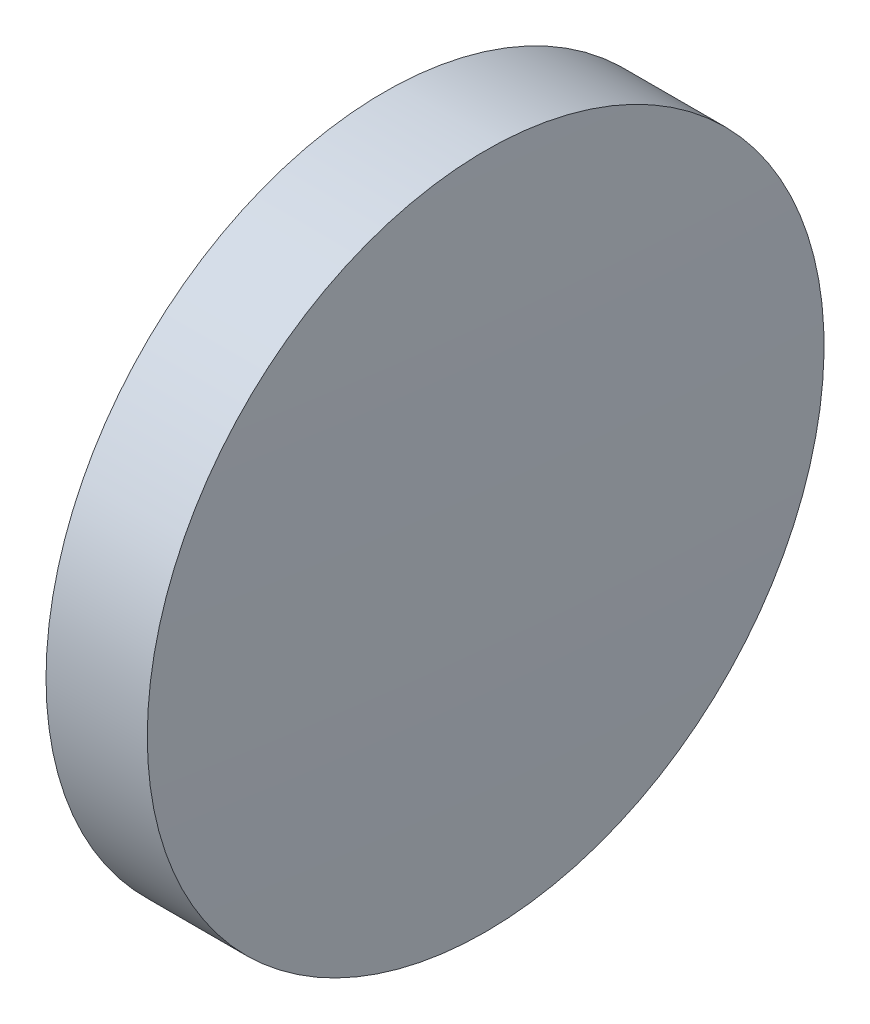
ISO-10303-21;
HEADER;
FILE_DESCRIPTION(('STEP AP214'),'2;1');
FILE_NAME('part.step','',(''),(''),'','','');
FILE_SCHEMA(('AUTOMOTIVE_DESIGN { 1 0 10303 214 1 1 1 1 }'));
ENDSEC;
DATA;
#1=APPLICATION_CONTEXT('core data for automotive mechanical design processes');
#2=APPLICATION_PROTOCOL_DEFINITION('international standard','automotive_design',2000,#1);
#3=PRODUCT_CONTEXT('',#1,'mechanical');
#4=PRODUCT('Part','Part','',(#3));
#5=PRODUCT_RELATED_PRODUCT_CATEGORY('part','',(#4));
#6=PRODUCT_DEFINITION_FORMATION('','',#4);
#7=PRODUCT_DEFINITION_CONTEXT('part definition',#1,'design');
#8=PRODUCT_DEFINITION('design','',#6,#7);
#9=PRODUCT_DEFINITION_SHAPE('','',#8);
#10=(LENGTH_UNIT() NAMED_UNIT(*) SI_UNIT(.MILLI.,.METRE.));
#11=(NAMED_UNIT(*) PLANE_ANGLE_UNIT() SI_UNIT($,.RADIAN.));
#12=(NAMED_UNIT(*) SI_UNIT($,.STERADIAN.) SOLID_ANGLE_UNIT());
#13=UNCERTAINTY_MEASURE_WITH_UNIT(LENGTH_MEASURE(1.E-05),#10,'distance_accuracy_value','');
#14=(GEOMETRIC_REPRESENTATION_CONTEXT(3) GLOBAL_UNCERTAINTY_ASSIGNED_CONTEXT((#13)) GLOBAL_UNIT_ASSIGNED_CONTEXT((#10,
#11,#12)) REPRESENTATION_CONTEXT('',''));
#15=CARTESIAN_POINT('',(0.,0.,0.));
#16=DIRECTION('',(0.,0.,1.));
#17=DIRECTION('',(1.,0.,0.));
#18=AXIS2_PLACEMENT_3D('',#15,#16,#17);
#19=CARTESIAN_POINT('',(88.3875078025128,125.178527758664,0.));
#20=DIRECTION('',(-1.,0.,0.));
#21=DIRECTION('',(0.,-1.,0.));
#22=AXIS2_PLACEMENT_3D('',#19,#20,#21);
#23=SPHERICAL_SURFACE('',#22,403.324999999994);
#24=CARTESIAN_POINT('',(491.512507802507,125.178527758662,0.));
#25=DIRECTION('',(-1.,0.,0.));
#26=DIRECTION('',(0.,0.,1.));
#27=AXIS2_PLACEMENT_3D('',#24,#25,#26);
#28=CIRCLE('',#27,12.7);
#29=CARTESIAN_POINT('',(491.512507802507,125.178527758662,12.7));
#30=VERTEX_POINT('',#29);
#31=EDGE_CURVE('E10',#30,#30,#28,.T.);
#32=ORIENTED_EDGE('',*,*,#31,.F.);
#33=EDGE_LOOP('',(#32));
#34=FACE_BOUND('',#33,.T.);
#35=ADVANCED_FACE('F35',(#34),#23,.T.);
#36=CARTESIAN_POINT('',(482.08261175135,125.178527758662,0.));
#37=DIRECTION('',(-1.,0.,0.));
#38=DIRECTION('',(0.,0.,1.));
#39=AXIS2_PLACEMENT_3D('',#36,#37,#38);
#40=CYLINDRICAL_SURFACE('',#39,12.7);
#41=CARTESIAN_POINT('',(487.712507802507,125.178527758662,0.));
#42=DIRECTION('',(-1.,0.,0.));
#43=DIRECTION('',(0.,0.,1.));
#44=AXIS2_PLACEMENT_3D('',#41,#42,#43);
#45=CIRCLE('',#44,12.7);
#46=CARTESIAN_POINT('',(487.712507802507,125.178527758662,12.7));
#47=VERTEX_POINT('',#46);
#48=EDGE_CURVE('E41',#47,#47,#45,.T.);
#49=ORIENTED_EDGE('',*,*,#48,.F.);
#50=EDGE_LOOP('',(#49));
#51=FACE_BOUND('',#50,.T.);
#52=ORIENTED_EDGE('',*,*,#31,.T.);
#53=EDGE_LOOP('',(#52));
#54=FACE_BOUND('',#53,.T.);
#55=ADVANCED_FACE('F49',(#51,#54),#40,.T.);
#56=CARTESIAN_POINT('',(487.712507802507,125.178527758662,0.));
#57=DIRECTION('',(1.,0.,0.));
#58=DIRECTION('',(0.,0.,-1.));
#59=AXIS2_PLACEMENT_3D('',#56,#57,#58);
#60=PLANE('',#59);
#61=ORIENTED_EDGE('',*,*,#48,.T.);
#62=EDGE_LOOP('',(#61));
#63=FACE_BOUND('',#62,.T.);
#64=ADVANCED_FACE('F47',(#63),#60,.F.);
#65=CLOSED_SHELL('',(#35,#55,#64));
#66=MANIFOLD_SOLID_BREP('B2',#65);
#67=ADVANCED_BREP_SHAPE_REPRESENTATION('',(#18,#66),#14);
#68=SHAPE_DEFINITION_REPRESENTATION(#9,#67);
ENDSEC;
END-ISO-10303-21;
